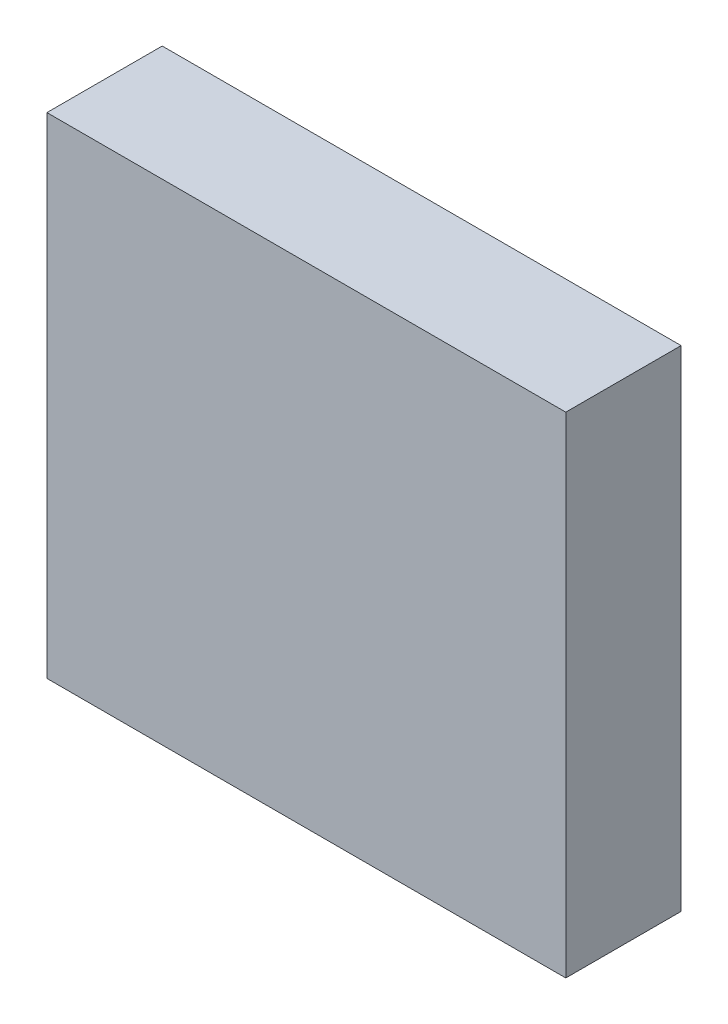
ISO-10303-21;
HEADER;
FILE_DESCRIPTION(('STEP AP214'),'2;1');
FILE_NAME('part.step','',(''),(''),'','','');
FILE_SCHEMA(('AUTOMOTIVE_DESIGN { 1 0 10303 214 1 1 1 1 }'));
ENDSEC;
DATA;
#1=APPLICATION_CONTEXT('core data for automotive mechanical design processes');
#2=APPLICATION_PROTOCOL_DEFINITION('international standard','automotive_design',2000,#1);
#3=PRODUCT_CONTEXT('',#1,'mechanical');
#4=PRODUCT('Part','Part','',(#3));
#5=PRODUCT_RELATED_PRODUCT_CATEGORY('part','',(#4));
#6=PRODUCT_DEFINITION_FORMATION('','',#4);
#7=PRODUCT_DEFINITION_CONTEXT('part definition',#1,'design');
#8=PRODUCT_DEFINITION('design','',#6,#7);
#9=PRODUCT_DEFINITION_SHAPE('','',#8);
#10=(LENGTH_UNIT() NAMED_UNIT(*) SI_UNIT(.MILLI.,.METRE.));
#11=(NAMED_UNIT(*) PLANE_ANGLE_UNIT() SI_UNIT($,.RADIAN.));
#12=(NAMED_UNIT(*) SI_UNIT($,.STERADIAN.) SOLID_ANGLE_UNIT());
#13=UNCERTAINTY_MEASURE_WITH_UNIT(LENGTH_MEASURE(1.E-05),#10,'distance_accuracy_value','');
#14=(GEOMETRIC_REPRESENTATION_CONTEXT(3) GLOBAL_UNCERTAINTY_ASSIGNED_CONTEXT((#13)) GLOBAL_UNIT_ASSIGNED_CONTEXT((#10,
#11,#12)) REPRESENTATION_CONTEXT('',''));
#15=CARTESIAN_POINT('',(0.,0.,0.));
#16=DIRECTION('',(0.,0.,1.));
#17=DIRECTION('',(1.,0.,0.));
#18=AXIS2_PLACEMENT_3D('',#15,#16,#17);
#19=CARTESIAN_POINT('',(61.9278272011201,20.6028430699161,20.));
#20=DIRECTION('',(1.,0.,0.));
#21=DIRECTION('',(0.,1.,0.));
#22=AXIS2_PLACEMENT_3D('',#19,#20,#21);
#23=PLANE('',#22);
#24=DIRECTION('',(0.,-1.,0.));
#25=VECTOR('',#24,1.);
#26=CARTESIAN_POINT('',(61.9278272011201,20.6028430699161,0.));
#27=LINE('',#26,#25);
#28=CARTESIAN_POINT('',(61.9278272011201,20.6028430699161,0.));
#29=VERTEX_POINT('',#28);
#30=CARTESIAN_POINT('',(61.9278272011201,-64.3971569300839,0.));
#31=VERTEX_POINT('',#30);
#32=EDGE_CURVE('E100',#29,#31,#27,.T.);
#33=ORIENTED_EDGE('',*,*,#32,.T.);
#34=DIRECTION('',(0.,0.,-1.));
#35=VECTOR('',#34,1.);
#36=CARTESIAN_POINT('',(61.9278272011201,-64.3971569300839,20.));
#37=LINE('',#36,#35);
#38=CARTESIAN_POINT('',(61.9278272011201,-64.3971569300839,20.));
#39=VERTEX_POINT('',#38);
#40=EDGE_CURVE('E11',#39,#31,#37,.T.);
#41=ORIENTED_EDGE('',*,*,#40,.F.);
#42=DIRECTION('',(0.,-1.,0.));
#43=VECTOR('',#42,1.);
#44=CARTESIAN_POINT('',(61.9278272011201,20.6028430699161,20.));
#45=LINE('',#44,#43);
#46=CARTESIAN_POINT('',(61.9278272011201,20.6028430699161,20.));
#47=VERTEX_POINT('',#46);
#48=EDGE_CURVE('E86',#47,#39,#45,.T.);
#49=ORIENTED_EDGE('',*,*,#48,.F.);
#50=DIRECTION('',(0.,0.,-1.));
#51=VECTOR('',#50,1.);
#52=CARTESIAN_POINT('',(61.9278272011201,20.6028430699161,20.));
#53=LINE('',#52,#51);
#54=EDGE_CURVE('E53',#47,#29,#53,.T.);
#55=ORIENTED_EDGE('',*,*,#54,.T.);
#56=EDGE_LOOP('',(#33,#41,#49,#55));
#57=FACE_BOUND('',#56,.T.);
#58=ADVANCED_FACE('F37',(#57),#23,.F.);
#59=CARTESIAN_POINT('',(61.9278272011201,-64.3971569300839,20.));
#60=DIRECTION('',(0.,1.,0.));
#61=DIRECTION('',(0.,0.,1.));
#62=AXIS2_PLACEMENT_3D('',#59,#60,#61);
#63=PLANE('',#62);
#64=DIRECTION('',(1.,0.,0.));
#65=VECTOR('',#64,1.);
#66=CARTESIAN_POINT('',(61.9278272011201,-64.3971569300839,0.));
#67=LINE('',#66,#65);
#68=CARTESIAN_POINT('',(151.92782720112,-64.3971569300839,0.));
#69=VERTEX_POINT('',#68);
#70=EDGE_CURVE('E91',#31,#69,#67,.T.);
#71=ORIENTED_EDGE('',*,*,#70,.T.);
#72=DIRECTION('',(0.,0.,-1.));
#73=VECTOR('',#72,1.);
#74=CARTESIAN_POINT('',(151.92782720112,-64.3971569300839,20.));
#75=LINE('',#74,#73);
#76=CARTESIAN_POINT('',(151.92782720112,-64.3971569300839,20.));
#77=VERTEX_POINT('',#76);
#78=EDGE_CURVE('E45',#77,#69,#75,.T.);
#79=ORIENTED_EDGE('',*,*,#78,.F.);
#80=DIRECTION('',(1.,0.,0.));
#81=VECTOR('',#80,1.);
#82=CARTESIAN_POINT('',(61.9278272011201,-64.3971569300839,20.));
#83=LINE('',#82,#81);
#84=EDGE_CURVE('E78',#39,#77,#83,.T.);
#85=ORIENTED_EDGE('',*,*,#84,.F.);
#86=ORIENTED_EDGE('',*,*,#40,.T.);
#87=EDGE_LOOP('',(#71,#79,#85,#86));
#88=FACE_BOUND('',#87,.T.);
#89=ADVANCED_FACE('F90',(#88),#63,.F.);
#90=CARTESIAN_POINT('',(151.92782720112,20.6028430699161,20.));
#91=DIRECTION('',(1.,0.,0.));
#92=DIRECTION('',(0.,1.,0.));
#93=AXIS2_PLACEMENT_3D('',#90,#91,#92);
#94=PLANE('',#93);
#95=DIRECTION('',(0.,-1.,0.));
#96=VECTOR('',#95,1.);
#97=CARTESIAN_POINT('',(151.92782720112,20.6028430699161,0.));
#98=LINE('',#97,#96);
#99=CARTESIAN_POINT('',(151.92782720112,20.6028430699161,0.));
#100=VERTEX_POINT('',#99);
#101=EDGE_CURVE('E103',#100,#69,#98,.T.);
#102=ORIENTED_EDGE('',*,*,#101,.F.);
#103=DIRECTION('',(0.,0.,-1.));
#104=VECTOR('',#103,1.);
#105=CARTESIAN_POINT('',(151.92782720112,20.6028430699161,20.));
#106=LINE('',#105,#104);
#107=CARTESIAN_POINT('',(151.92782720112,20.6028430699161,20.));
#108=VERTEX_POINT('',#107);
#109=EDGE_CURVE('E67',#108,#100,#106,.T.);
#110=ORIENTED_EDGE('',*,*,#109,.F.);
#111=DIRECTION('',(0.,-1.,0.));
#112=VECTOR('',#111,1.);
#113=CARTESIAN_POINT('',(151.92782720112,20.6028430699161,20.));
#114=LINE('',#113,#112);
#115=EDGE_CURVE('E85',#108,#77,#114,.T.);
#116=ORIENTED_EDGE('',*,*,#115,.T.);
#117=ORIENTED_EDGE('',*,*,#78,.T.);
#118=EDGE_LOOP('',(#102,#110,#116,#117));
#119=FACE_BOUND('',#118,.T.);
#120=ADVANCED_FACE('F94',(#119),#94,.T.);
#121=CARTESIAN_POINT('',(61.9278272011201,20.6028430699161,20.));
#122=DIRECTION('',(0.,1.,0.));
#123=DIRECTION('',(0.,0.,1.));
#124=AXIS2_PLACEMENT_3D('',#121,#122,#123);
#125=PLANE('',#124);
#126=DIRECTION('',(1.,0.,0.));
#127=VECTOR('',#126,1.);
#128=CARTESIAN_POINT('',(61.9278272011201,20.6028430699161,0.));
#129=LINE('',#128,#127);
#130=EDGE_CURVE('E105',#29,#100,#129,.T.);
#131=ORIENTED_EDGE('',*,*,#130,.F.);
#132=ORIENTED_EDGE('',*,*,#54,.F.);
#133=DIRECTION('',(1.,0.,0.));
#134=VECTOR('',#133,1.);
#135=CARTESIAN_POINT('',(61.9278272011201,20.6028430699161,20.));
#136=LINE('',#135,#134);
#137=EDGE_CURVE('E95',#47,#108,#136,.T.);
#138=ORIENTED_EDGE('',*,*,#137,.T.);
#139=ORIENTED_EDGE('',*,*,#109,.T.);
#140=EDGE_LOOP('',(#131,#132,#138,#139));
#141=FACE_BOUND('',#140,.T.);
#142=ADVANCED_FACE('F111',(#141),#125,.T.);
#143=CARTESIAN_POINT('',(0.,0.,20.));
#144=DIRECTION('',(0.,0.,1.));
#145=DIRECTION('',(1.,0.,0.));
#146=AXIS2_PLACEMENT_3D('',#143,#144,#145);
#147=PLANE('',#146);
#148=ORIENTED_EDGE('',*,*,#48,.T.);
#149=ORIENTED_EDGE('',*,*,#84,.T.);
#150=ORIENTED_EDGE('',*,*,#115,.F.);
#151=ORIENTED_EDGE('',*,*,#137,.F.);
#152=EDGE_LOOP('',(#148,#149,#150,#151));
#153=FACE_BOUND('',#152,.T.);
#154=ADVANCED_FACE('F82',(#153),#147,.T.);
#155=CARTESIAN_POINT('',(0.,0.,0.));
#156=DIRECTION('',(0.,0.,1.));
#157=DIRECTION('',(1.,0.,0.));
#158=AXIS2_PLACEMENT_3D('',#155,#156,#157);
#159=PLANE('',#158);
#160=ORIENTED_EDGE('',*,*,#32,.F.);
#161=ORIENTED_EDGE('',*,*,#130,.T.);
#162=ORIENTED_EDGE('',*,*,#101,.T.);
#163=ORIENTED_EDGE('',*,*,#70,.F.);
#164=EDGE_LOOP('',(#160,#161,#162,#163));
#165=FACE_BOUND('',#164,.T.);
#166=ADVANCED_FACE('F110',(#165),#159,.F.);
#167=CLOSED_SHELL('',(#58,#89,#120,#142,#154,#166));
#168=MANIFOLD_SOLID_BREP('B2',#167);
#169=ADVANCED_BREP_SHAPE_REPRESENTATION('',(#18,#168),#14);
#170=SHAPE_DEFINITION_REPRESENTATION(#9,#169);
ENDSEC;
END-ISO-10303-21;
